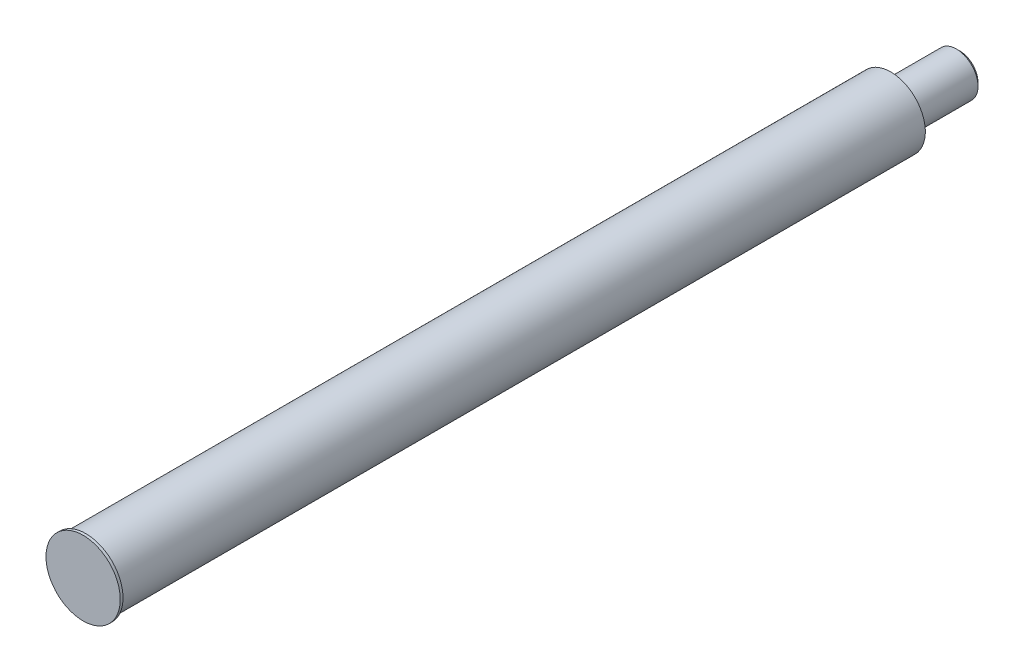
ISO-10303-21;
HEADER;
FILE_DESCRIPTION(('STEP AP214'),'2;1');
FILE_NAME('part.step','',(''),(''),'','','');
FILE_SCHEMA(('AUTOMOTIVE_DESIGN { 1 0 10303 214 1 1 1 1 }'));
ENDSEC;
DATA;
#1=APPLICATION_CONTEXT('core data for automotive mechanical design processes');
#2=APPLICATION_PROTOCOL_DEFINITION('international standard','automotive_design',2000,#1);
#3=PRODUCT_CONTEXT('',#1,'mechanical');
#4=PRODUCT('Part','Part','',(#3));
#5=PRODUCT_RELATED_PRODUCT_CATEGORY('part','',(#4));
#6=PRODUCT_DEFINITION_FORMATION('','',#4);
#7=PRODUCT_DEFINITION_CONTEXT('part definition',#1,'design');
#8=PRODUCT_DEFINITION('design','',#6,#7);
#9=PRODUCT_DEFINITION_SHAPE('','',#8);
#10=(LENGTH_UNIT() NAMED_UNIT(*) SI_UNIT(.MILLI.,.METRE.));
#11=(NAMED_UNIT(*) PLANE_ANGLE_UNIT() SI_UNIT($,.RADIAN.));
#12=(NAMED_UNIT(*) SI_UNIT($,.STERADIAN.) SOLID_ANGLE_UNIT());
#13=UNCERTAINTY_MEASURE_WITH_UNIT(LENGTH_MEASURE(1.E-05),#10,'distance_accuracy_value','');
#14=(GEOMETRIC_REPRESENTATION_CONTEXT(3) GLOBAL_UNCERTAINTY_ASSIGNED_CONTEXT((#13)) GLOBAL_UNIT_ASSIGNED_CONTEXT((#10,
#11,#12)) REPRESENTATION_CONTEXT('',''));
#15=CARTESIAN_POINT('',(0.,0.,0.));
#16=DIRECTION('',(0.,0.,1.));
#17=DIRECTION('',(1.,0.,0.));
#18=AXIS2_PLACEMENT_3D('',#15,#16,#17);
#19=CARTESIAN_POINT('',(0.,10.5000000000001,-507.6002));
#20=DIRECTION('',(0.,0.,-1.));
#21=DIRECTION('',(-1.,0.,0.));
#22=AXIS2_PLACEMENT_3D('',#19,#20,#21);
#23=PLANE('',#22);
#24=CARTESIAN_POINT('',(0.,0.,-507.6002));
#25=DIRECTION('',(0.,0.,1.));
#26=DIRECTION('',(1.,0.,0.));
#27=AXIS2_PLACEMENT_3D('',#24,#25,#26);
#28=CIRCLE('',#27,10.5000000000001);
#29=CARTESIAN_POINT('',(10.5000000000001,0.,-507.6002));
#30=VERTEX_POINT('',#29);
#31=EDGE_CURVE('E17',#30,#30,#28,.T.);
#32=ORIENTED_EDGE('',*,*,#31,.F.);
#33=EDGE_LOOP('',(#32));
#34=FACE_BOUND('',#33,.T.);
#35=ADVANCED_FACE('F14',(#34),#23,.T.);
#36=CARTESIAN_POINT('',(0.,0.,-505.6002));
#37=DIRECTION('',(0.,0.,1.));
#38=DIRECTION('',(1.,0.,0.));
#39=AXIS2_PLACEMENT_3D('',#36,#37,#38);
#40=CONICAL_SURFACE('',#39,12.5000000000001,0.785398163397448);
#41=ORIENTED_EDGE('',*,*,#31,.T.);
#42=EDGE_LOOP('',(#41));
#43=FACE_BOUND('',#42,.T.);
#44=CARTESIAN_POINT('',(0.,0.,-505.6002));
#45=DIRECTION('',(0.,0.,-1.));
#46=DIRECTION('',(-1.,0.,0.));
#47=AXIS2_PLACEMENT_3D('',#44,#45,#46);
#48=CIRCLE('',#47,12.5000000000001);
#49=CARTESIAN_POINT('',(-12.5000000000001,0.,-505.6002));
#50=VERTEX_POINT('',#49);
#51=EDGE_CURVE('E29',#50,#50,#48,.F.);
#52=ORIENTED_EDGE('',*,*,#51,.F.);
#53=EDGE_LOOP('',(#52));
#54=FACE_BOUND('',#53,.T.);
#55=ADVANCED_FACE('F48',(#43,#54),#40,.T.);
#56=CARTESIAN_POINT('',(0.,0.,0.));
#57=DIRECTION('',(0.,0.,1.));
#58=DIRECTION('',(1.,0.,0.));
#59=AXIS2_PLACEMENT_3D('',#56,#57,#58);
#60=PLANE('',#59);
#61=CARTESIAN_POINT('',(0.,0.,0.));
#62=DIRECTION('',(0.,0.,-1.));
#63=DIRECTION('',(-1.,0.,0.));
#64=AXIS2_PLACEMENT_3D('',#61,#62,#63);
#65=CIRCLE('',#64,21.5);
#66=CARTESIAN_POINT('',(-21.5,0.,0.));
#67=VERTEX_POINT('',#66);
#68=EDGE_CURVE('E37',#67,#67,#65,.T.);
#69=ORIENTED_EDGE('',*,*,#68,.F.);
#70=EDGE_LOOP('',(#69));
#71=FACE_BOUND('',#70,.T.);
#72=ADVANCED_FACE('F56',(#71),#60,.T.);
#73=CARTESIAN_POINT('',(0.,0.,0.));
#74=DIRECTION('',(0.,0.,-1.));
#75=DIRECTION('',(-1.,0.,0.));
#76=AXIS2_PLACEMENT_3D('',#73,#74,#75);
#77=CYLINDRICAL_SURFACE('',#76,12.5000000000001);
#78=CARTESIAN_POINT('',(0.,0.,-469.6002));
#79=DIRECTION('',(0.,0.,-1.));
#80=DIRECTION('',(-1.,0.,0.));
#81=AXIS2_PLACEMENT_3D('',#78,#79,#80);
#82=CIRCLE('',#81,12.5000000000001);
#83=CARTESIAN_POINT('',(-12.5000000000001,0.,-469.6002));
#84=VERTEX_POINT('',#83);
#85=EDGE_CURVE('E36',#84,#84,#82,.F.);
#86=ORIENTED_EDGE('',*,*,#85,.F.);
#87=EDGE_LOOP('',(#86));
#88=FACE_BOUND('',#87,.T.);
#89=ORIENTED_EDGE('',*,*,#51,.T.);
#90=EDGE_LOOP('',(#89));
#91=FACE_BOUND('',#90,.T.);
#92=ADVANCED_FACE('F80',(#88,#91),#77,.T.);
#93=CARTESIAN_POINT('',(0.,0.,0.));
#94=DIRECTION('',(0.,0.,-1.));
#95=DIRECTION('',(-1.,0.,0.));
#96=AXIS2_PLACEMENT_3D('',#93,#94,#95);
#97=CYLINDRICAL_SURFACE('',#96,21.5);
#98=ORIENTED_EDGE('',*,*,#68,.T.);
#99=EDGE_LOOP('',(#98));
#100=FACE_BOUND('',#99,.T.);
#101=CARTESIAN_POINT('',(0.,0.,-1.6002));
#102=DIRECTION('',(0.,0.,-1.));
#103=DIRECTION('',(-1.,0.,0.));
#104=AXIS2_PLACEMENT_3D('',#101,#102,#103);
#105=CIRCLE('',#104,21.5);
#106=CARTESIAN_POINT('',(-21.5,0.,-1.6002));
#107=VERTEX_POINT('',#106);
#108=EDGE_CURVE('E34',#107,#107,#105,.T.);
#109=ORIENTED_EDGE('',*,*,#108,.F.);
#110=EDGE_LOOP('',(#109));
#111=FACE_BOUND('',#110,.T.);
#112=ADVANCED_FACE('F76',(#100,#111),#97,.T.);
#113=CARTESIAN_POINT('',(0.,0.,-469.6002));
#114=DIRECTION('',(0.,0.,-1.));
#115=DIRECTION('',(-1.,0.,0.));
#116=AXIS2_PLACEMENT_3D('',#113,#114,#115);
#117=CONICAL_SURFACE('',#116,12.5000000000001,0.785398163397459);
#118=CARTESIAN_POINT('',(0.,0.,-467.6002));
#119=DIRECTION('',(0.,0.,-1.));
#120=DIRECTION('',(-1.,0.,0.));
#121=AXIS2_PLACEMENT_3D('',#118,#119,#120);
#122=CIRCLE('',#121,10.5000000000001);
#123=CARTESIAN_POINT('',(-10.5000000000001,0.,-467.6002));
#124=VERTEX_POINT('',#123);
#125=EDGE_CURVE('E26',#124,#124,#122,.F.);
#126=ORIENTED_EDGE('',*,*,#125,.F.);
#127=EDGE_LOOP('',(#126));
#128=FACE_BOUND('',#127,.T.);
#129=ORIENTED_EDGE('',*,*,#85,.T.);
#130=EDGE_LOOP('',(#129));
#131=FACE_BOUND('',#130,.T.);
#132=ADVANCED_FACE('F72',(#128,#131),#117,.T.);
#133=CARTESIAN_POINT('',(0.,21.5,-1.6002));
#134=DIRECTION('',(0.,0.,-1.));
#135=DIRECTION('',(-1.,0.,0.));
#136=AXIS2_PLACEMENT_3D('',#133,#134,#135);
#137=PLANE('',#136);
#138=CARTESIAN_POINT('',(0.,0.,-1.6002));
#139=DIRECTION('',(0.,0.,-1.));
#140=DIRECTION('',(-1.,0.,0.));
#141=AXIS2_PLACEMENT_3D('',#138,#139,#140);
#142=CIRCLE('',#141,20.);
#143=CARTESIAN_POINT('',(-20.,0.,-1.6002));
#144=VERTEX_POINT('',#143);
#145=EDGE_CURVE('E21',#144,#144,#142,.T.);
#146=ORIENTED_EDGE('',*,*,#145,.F.);
#147=EDGE_LOOP('',(#146));
#148=FACE_BOUND('',#147,.T.);
#149=ORIENTED_EDGE('',*,*,#108,.T.);
#150=EDGE_LOOP('',(#149));
#151=FACE_BOUND('',#150,.T.);
#152=ADVANCED_FACE('F65',(#148,#151),#137,.T.);
#153=CARTESIAN_POINT('',(0.,20.,-467.6002));
#154=DIRECTION('',(0.,0.,-1.));
#155=DIRECTION('',(-1.,0.,0.));
#156=AXIS2_PLACEMENT_3D('',#153,#154,#155);
#157=PLANE('',#156);
#158=ORIENTED_EDGE('',*,*,#125,.T.);
#159=EDGE_LOOP('',(#158));
#160=FACE_BOUND('',#159,.T.);
#161=CARTESIAN_POINT('',(0.,0.,-467.6002));
#162=DIRECTION('',(0.,0.,-1.));
#163=DIRECTION('',(-1.,0.,0.));
#164=AXIS2_PLACEMENT_3D('',#161,#162,#163);
#165=CIRCLE('',#164,20.);
#166=CARTESIAN_POINT('',(-20.,0.,-467.6002));
#167=VERTEX_POINT('',#166);
#168=EDGE_CURVE('E10',#167,#167,#165,.F.);
#169=ORIENTED_EDGE('',*,*,#168,.F.);
#170=EDGE_LOOP('',(#169));
#171=FACE_BOUND('',#170,.T.);
#172=ADVANCED_FACE('F59',(#160,#171),#157,.T.);
#173=CARTESIAN_POINT('',(0.,0.,0.));
#174=DIRECTION('',(0.,0.,-1.));
#175=DIRECTION('',(-1.,0.,0.));
#176=AXIS2_PLACEMENT_3D('',#173,#174,#175);
#177=CYLINDRICAL_SURFACE('',#176,20.);
#178=ORIENTED_EDGE('',*,*,#168,.T.);
#179=EDGE_LOOP('',(#178));
#180=FACE_BOUND('',#179,.T.);
#181=ORIENTED_EDGE('',*,*,#145,.T.);
#182=EDGE_LOOP('',(#181));
#183=FACE_BOUND('',#182,.T.);
#184=ADVANCED_FACE('F57',(#180,#183),#177,.T.);
#185=CLOSED_SHELL('',(#35,#55,#72,#92,#112,#132,#152,#172,#184));
#186=MANIFOLD_SOLID_BREP('B1',#185);
#187=ADVANCED_BREP_SHAPE_REPRESENTATION('',(#18,#186),#14);
#188=SHAPE_DEFINITION_REPRESENTATION(#9,#187);
ENDSEC;
END-ISO-10303-21;
